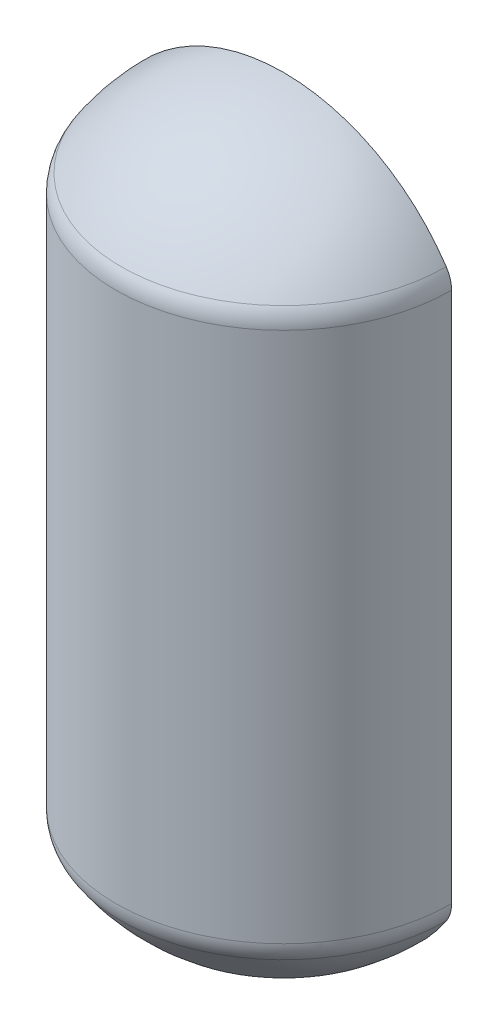
ISO-10303-21;
HEADER;
FILE_DESCRIPTION(('STEP AP214'),'2;1');
FILE_NAME('part.step','',(''),(''),'','','');
FILE_SCHEMA(('AUTOMOTIVE_DESIGN { 1 0 10303 214 1 1 1 1 }'));
ENDSEC;
DATA;
#1=APPLICATION_CONTEXT('core data for automotive mechanical design processes');
#2=APPLICATION_PROTOCOL_DEFINITION('international standard','automotive_design',2000,#1);
#3=PRODUCT_CONTEXT('',#1,'mechanical');
#4=PRODUCT('Part','Part','',(#3));
#5=PRODUCT_RELATED_PRODUCT_CATEGORY('part','',(#4));
#6=PRODUCT_DEFINITION_FORMATION('','',#4);
#7=PRODUCT_DEFINITION_CONTEXT('part definition',#1,'design');
#8=PRODUCT_DEFINITION('design','',#6,#7);
#9=PRODUCT_DEFINITION_SHAPE('','',#8);
#10=(LENGTH_UNIT() NAMED_UNIT(*) SI_UNIT(.MILLI.,.METRE.));
#11=(NAMED_UNIT(*) PLANE_ANGLE_UNIT() SI_UNIT($,.RADIAN.));
#12=(NAMED_UNIT(*) SI_UNIT($,.STERADIAN.) SOLID_ANGLE_UNIT());
#13=UNCERTAINTY_MEASURE_WITH_UNIT(LENGTH_MEASURE(1.E-05),#10,'distance_accuracy_value','');
#14=(GEOMETRIC_REPRESENTATION_CONTEXT(3) GLOBAL_UNCERTAINTY_ASSIGNED_CONTEXT((#13)) GLOBAL_UNIT_ASSIGNED_CONTEXT((#10,
#11,#12)) REPRESENTATION_CONTEXT('',''));
#15=CARTESIAN_POINT('',(0.,0.,0.));
#16=DIRECTION('',(0.,0.,1.));
#17=DIRECTION('',(1.,0.,0.));
#18=AXIS2_PLACEMENT_3D('',#15,#16,#17);
#19=CARTESIAN_POINT('',(0.,764.795145833333,0.));
#20=DIRECTION('',(0.,-1.,0.));
#21=DIRECTION('',(-1.,0.,0.));
#22=AXIS2_PLACEMENT_3D('',#19,#20,#21);
#23=SPHERICAL_SURFACE('',#22,155.895145833333);
#24=CARTESIAN_POINT('',(0.,764.795145833333,0.));
#25=DIRECTION('',(0.,0.,-1.));
#26=DIRECTION('',(-1.,0.,0.));
#27=AXIS2_PLACEMENT_3D('',#24,#25,#26);
#28=CIRCLE('',#27,155.895145833333);
#29=CARTESIAN_POINT('',(-129.720337888526,678.331682841831,9.0583227801243E-13));
#30=VERTEX_POINT('',#29);
#31=CARTESIAN_POINT('',(129.720337888526,678.331682841831,-9.05832278012429E-13));
#32=VERTEX_POINT('',#31);
#33=EDGE_CURVE('E87',#30,#32,#28,.F.);
#34=ORIENTED_EDGE('',*,*,#33,.T.);
#35=CARTESIAN_POINT('',(0.,678.331682841831,0.));
#36=DIRECTION('',(0.,1.,0.));
#37=DIRECTION('',(0.,0.,1.));
#38=AXIS2_PLACEMENT_3D('',#35,#36,#37);
#39=CIRCLE('',#38,129.720337888526);
#40=EDGE_CURVE('E79',#32,#30,#39,.F.);
#41=ORIENTED_EDGE('',*,*,#40,.T.);
#42=EDGE_LOOP('',(#34,#41));
#43=FACE_BOUND('',#42,.T.);
#44=ADVANCED_FACE('F35',(#43),#23,.T.);
#45=CARTESIAN_POINT('',(0.,1044.10485416667,0.));
#46=DIRECTION('',(0.,-1.,0.));
#47=DIRECTION('',(1.,0.,0.));
#48=AXIS2_PLACEMENT_3D('',#45,#46,#47);
#49=SPHERICAL_SURFACE('',#48,155.895145833333);
#50=CARTESIAN_POINT('',(0.,1044.10485416667,0.));
#51=DIRECTION('',(0.,0.,-1.));
#52=DIRECTION('',(-1.,0.,0.));
#53=AXIS2_PLACEMENT_3D('',#50,#51,#52);
#54=CIRCLE('',#53,155.895145833333);
#55=CARTESIAN_POINT('',(-129.720337888526,1130.56831715817,9.0583227801243E-13));
#56=VERTEX_POINT('',#55);
#57=CARTESIAN_POINT('',(129.720337888526,1130.56831715817,-9.0583227801243E-13));
#58=VERTEX_POINT('',#57);
#59=EDGE_CURVE('E91',#56,#58,#54,.T.);
#60=ORIENTED_EDGE('',*,*,#59,.F.);
#61=CARTESIAN_POINT('',(0.,1130.56831715817,0.));
#62=DIRECTION('',(0.,-0.999999999999999,0.));
#63=DIRECTION('',(0.,0.,-1.));
#64=AXIS2_PLACEMENT_3D('',#61,#62,#63);
#65=CIRCLE('',#64,129.720337888526);
#66=EDGE_CURVE('E11',#56,#58,#65,.F.);
#67=ORIENTED_EDGE('',*,*,#66,.T.);
#68=EDGE_LOOP('',(#60,#67));
#69=FACE_BOUND('',#68,.T.);
#70=ADVANCED_FACE('F109',(#69),#49,.T.);
#71=CARTESIAN_POINT('',(0.,0.,0.));
#72=DIRECTION('',(0.,-1.,0.));
#73=DIRECTION('',(0.,0.,-1.));
#74=AXIS2_PLACEMENT_3D('',#71,#72,#73);
#75=CYLINDRICAL_SURFACE('',#74,133.985);
#76=DIRECTION('',(0.,-1.,0.));
#77=VECTOR('',#76,1.);
#78=CARTESIAN_POINT('',(-133.985,0.,0.));
#79=LINE('',#78,#77);
#80=CARTESIAN_POINT('',(-133.985,1116.48082297582,0.));
#81=VERTEX_POINT('',#80);
#82=CARTESIAN_POINT('',(-133.985,692.419177024184,0.));
#83=VERTEX_POINT('',#82);
#84=EDGE_CURVE('E92',#81,#83,#79,.T.);
#85=ORIENTED_EDGE('',*,*,#84,.T.);
#86=CARTESIAN_POINT('',(0.,692.419177024184,0.));
#87=DIRECTION('',(0.,1.,0.));
#88=DIRECTION('',(0.,0.,1.));
#89=AXIS2_PLACEMENT_3D('',#86,#87,#88);
#90=CIRCLE('',#89,133.985);
#91=CARTESIAN_POINT('',(133.985,692.419177024184,-9.35612254369794E-13));
#92=VERTEX_POINT('',#91);
#93=EDGE_CURVE('E43',#83,#92,#90,.T.);
#94=ORIENTED_EDGE('',*,*,#93,.T.);
#95=DIRECTION('',(0.,-1.,0.));
#96=VECTOR('',#95,1.);
#97=CARTESIAN_POINT('',(133.985,0.,-9.35612254369793E-13));
#98=LINE('',#97,#96);
#99=CARTESIAN_POINT('',(133.985,1116.48082297582,-9.35612254369794E-13));
#100=VERTEX_POINT('',#99);
#101=EDGE_CURVE('E88',#100,#92,#98,.T.);
#102=ORIENTED_EDGE('',*,*,#101,.F.);
#103=CARTESIAN_POINT('',(0.,1116.48082297582,0.));
#104=DIRECTION('',(0.,-0.999999999999999,0.));
#105=DIRECTION('',(0.,0.,-1.));
#106=AXIS2_PLACEMENT_3D('',#103,#104,#105);
#107=CIRCLE('',#106,133.985);
#108=EDGE_CURVE('E82',#100,#81,#107,.T.);
#109=ORIENTED_EDGE('',*,*,#108,.T.);
#110=EDGE_LOOP('',(#85,#94,#102,#109));
#111=FACE_BOUND('',#110,.T.);
#112=ADVANCED_FACE('F104',(#111),#75,.T.);
#113=CARTESIAN_POINT('',(0.,0.,0.));
#114=DIRECTION('',(0.,0.,-1.));
#115=DIRECTION('',(-1.,0.,0.));
#116=AXIS2_PLACEMENT_3D('',#113,#114,#115);
#117=PLANE('',#116);
#118=ORIENTED_EDGE('',*,*,#33,.F.);
#119=CARTESIAN_POINT('',(-108.585,692.419177024184,7.58245002356563E-13));
#120=DIRECTION('',(0.,0.,-1.));
#121=DIRECTION('',(-1.,0.,0.));
#122=AXIS2_PLACEMENT_3D('',#119,#120,#121);
#123=CIRCLE('',#122,25.4);
#124=EDGE_CURVE('E75',#30,#83,#123,.T.);
#125=ORIENTED_EDGE('',*,*,#124,.T.);
#126=ORIENTED_EDGE('',*,*,#84,.F.);
#127=CARTESIAN_POINT('',(-108.585,1116.48082297582,7.58245002356563E-13));
#128=DIRECTION('',(0.,0.,-1.));
#129=DIRECTION('',(-1.,0.,0.));
#130=AXIS2_PLACEMENT_3D('',#127,#128,#129);
#131=CIRCLE('',#130,25.4);
#132=EDGE_CURVE('E99',#81,#56,#131,.T.);
#133=ORIENTED_EDGE('',*,*,#132,.T.);
#134=ORIENTED_EDGE('',*,*,#59,.T.);
#135=CARTESIAN_POINT('',(108.585,1116.48082297582,-7.58245002356563E-13));
#136=DIRECTION('',(0.,0.,-1.));
#137=DIRECTION('',(-1.,0.,0.));
#138=AXIS2_PLACEMENT_3D('',#135,#136,#137);
#139=CIRCLE('',#138,25.4);
#140=EDGE_CURVE('E56',#58,#100,#139,.T.);
#141=ORIENTED_EDGE('',*,*,#140,.T.);
#142=ORIENTED_EDGE('',*,*,#101,.T.);
#143=CARTESIAN_POINT('',(108.585,692.419177024184,-7.58245002356563E-13));
#144=DIRECTION('',(0.,0.,-1.));
#145=DIRECTION('',(-1.,0.,0.));
#146=AXIS2_PLACEMENT_3D('',#143,#144,#145);
#147=CIRCLE('',#146,25.4);
#148=EDGE_CURVE('E83',#92,#32,#147,.T.);
#149=ORIENTED_EDGE('',*,*,#148,.T.);
#150=EDGE_LOOP('',(#118,#125,#126,#133,#134,#141,#142,#149));
#151=FACE_BOUND('',#150,.T.);
#152=ADVANCED_FACE('F90',(#151),#117,.T.);
#153=CARTESIAN_POINT('',(0.,692.419177024184,0.));
#154=DIRECTION('',(0.,1.,0.));
#155=DIRECTION('',(0.,0.,1.));
#156=AXIS2_PLACEMENT_3D('',#153,#154,#155);
#157=TOROIDAL_SURFACE('',#156,108.585,25.4);
#158=ORIENTED_EDGE('',*,*,#148,.F.);
#159=ORIENTED_EDGE('',*,*,#93,.F.);
#160=ORIENTED_EDGE('',*,*,#124,.F.);
#161=ORIENTED_EDGE('',*,*,#40,.F.);
#162=EDGE_LOOP('',(#158,#159,#160,#161));
#163=FACE_BOUND('',#162,.T.);
#164=ADVANCED_FACE('F78',(#163),#157,.T.);
#165=CARTESIAN_POINT('',(0.,1116.48082297582,0.));
#166=DIRECTION('',(0.,-0.999999999999999,0.));
#167=DIRECTION('',(0.,0.,-1.));
#168=AXIS2_PLACEMENT_3D('',#165,#166,#167);
#169=TOROIDAL_SURFACE('',#168,108.585,25.4);
#170=ORIENTED_EDGE('',*,*,#140,.F.);
#171=ORIENTED_EDGE('',*,*,#66,.F.);
#172=ORIENTED_EDGE('',*,*,#132,.F.);
#173=ORIENTED_EDGE('',*,*,#108,.F.);
#174=EDGE_LOOP('',(#170,#171,#172,#173));
#175=FACE_BOUND('',#174,.T.);
#176=ADVANCED_FACE('F37',(#175),#169,.T.);
#177=CLOSED_SHELL('',(#44,#70,#112,#152,#164,#176));
#178=MANIFOLD_SOLID_BREP('B2',#177);
#179=ADVANCED_BREP_SHAPE_REPRESENTATION('',(#18,#178),#14);
#180=SHAPE_DEFINITION_REPRESENTATION(#9,#179);
ENDSEC;
END-ISO-10303-21;
